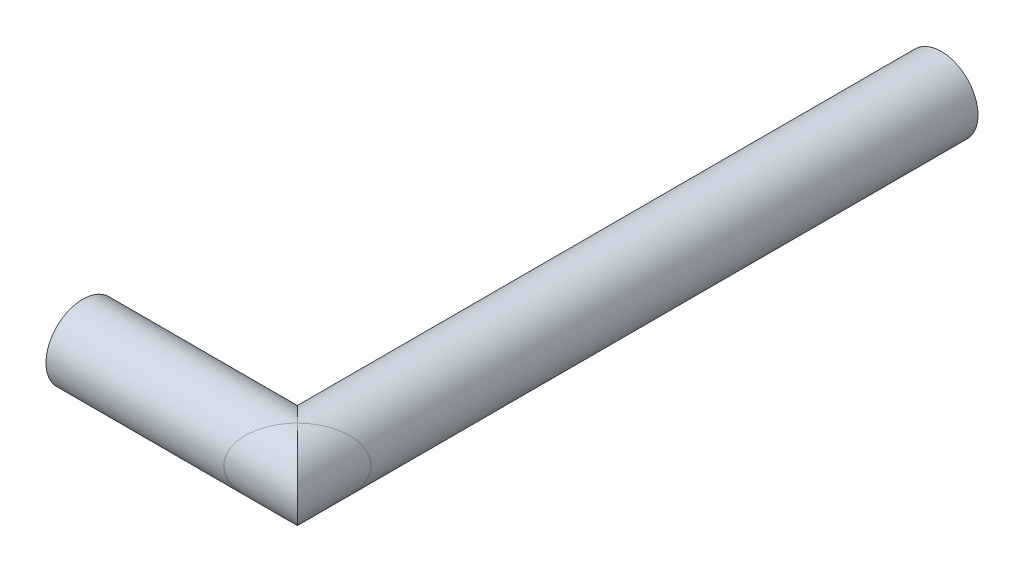
ISO-10303-21;
HEADER;
FILE_DESCRIPTION(('STEP AP214'),'2;1');
FILE_NAME('part.step','',(''),(''),'','','');
FILE_SCHEMA(('AUTOMOTIVE_DESIGN { 1 0 10303 214 1 1 1 1 }'));
ENDSEC;
DATA;
#1=APPLICATION_CONTEXT('core data for automotive mechanical design processes');
#2=APPLICATION_PROTOCOL_DEFINITION('international standard','automotive_design',2000,#1);
#3=PRODUCT_CONTEXT('',#1,'mechanical');
#4=PRODUCT('Part','Part','',(#3));
#5=PRODUCT_RELATED_PRODUCT_CATEGORY('part','',(#4));
#6=PRODUCT_DEFINITION_FORMATION('','',#4);
#7=PRODUCT_DEFINITION_CONTEXT('part definition',#1,'design');
#8=PRODUCT_DEFINITION('design','',#6,#7);
#9=PRODUCT_DEFINITION_SHAPE('','',#8);
#10=(LENGTH_UNIT() NAMED_UNIT(*) SI_UNIT(.MILLI.,.METRE.));
#11=(NAMED_UNIT(*) PLANE_ANGLE_UNIT() SI_UNIT($,.RADIAN.));
#12=(NAMED_UNIT(*) SI_UNIT($,.STERADIAN.) SOLID_ANGLE_UNIT());
#13=UNCERTAINTY_MEASURE_WITH_UNIT(LENGTH_MEASURE(1.E-05),#10,'distance_accuracy_value','');
#14=(GEOMETRIC_REPRESENTATION_CONTEXT(3) GLOBAL_UNCERTAINTY_ASSIGNED_CONTEXT((#13)) GLOBAL_UNIT_ASSIGNED_CONTEXT((#10,
#11,#12)) REPRESENTATION_CONTEXT('',''));
#15=CARTESIAN_POINT('',(0.,0.,0.));
#16=DIRECTION('',(0.,0.,1.));
#17=DIRECTION('',(1.,0.,0.));
#18=AXIS2_PLACEMENT_3D('',#15,#16,#17);
#19=CARTESIAN_POINT('',(5.,0.,0.95));
#20=DIRECTION('',(0.,0.,-1.));
#21=DIRECTION('',(0.,-1.,0.));
#22=AXIS2_PLACEMENT_3D('',#19,#20,#21);
#23=CYLINDRICAL_SURFACE('',#22,0.3);
#24=CARTESIAN_POINT('',(5.,0.,1.25));
#25=DIRECTION('',(-0.707106781186548,0.,-0.707106781186547));
#26=DIRECTION('',(0.707106781186547,0.,-0.707106781186548));
#27=AXIS2_PLACEMENT_3D('',#24,#25,#26);
#28=ELLIPSE('',#27,0.424264068711929,0.3);
#29=CARTESIAN_POINT('',(5.,-0.3,1.25));
#30=VERTEX_POINT('',#29);
#31=CARTESIAN_POINT('',(5.,0.3,1.25));
#32=VERTEX_POINT('',#31);
#33=EDGE_CURVE('E30',#30,#32,#28,.F.);
#34=ORIENTED_EDGE('',*,*,#33,.T.);
#35=CARTESIAN_POINT('',(5.,0.,1.25));
#36=DIRECTION('',(0.707106781186547,0.,-0.707106781186548));
#37=DIRECTION('',(-0.707106781186548,0.,-0.707106781186547));
#38=AXIS2_PLACEMENT_3D('',#35,#36,#37);
#39=ELLIPSE('',#38,0.424264068711929,0.3);
#40=EDGE_CURVE('E24',#32,#30,#39,.T.);
#41=ORIENTED_EDGE('',*,*,#40,.T.);
#42=EDGE_LOOP('',(#34,#41));
#43=FACE_BOUND('',#42,.T.);
#44=ADVANCED_FACE('F16',(#43),#23,.T.);
#45=CARTESIAN_POINT('',(5.,0.,1.25));
#46=DIRECTION('',(0.707106781186547,0.,-0.707106781186548));
#47=DIRECTION('',(-0.707106781186548,0.,-0.707106781186547));
#48=AXIS2_PLACEMENT_3D('',#45,#46,#47);
#49=ELLIPSE('',#48,0.424264068711929,0.3);
#50=EDGE_CURVE('E10',#32,#30,#49,.F.);
#51=ORIENTED_EDGE('',*,*,#50,.F.);
#52=ORIENTED_EDGE('',*,*,#33,.F.);
#53=EDGE_LOOP('',(#51,#52));
#54=FACE_BOUND('',#53,.T.);
#55=CARTESIAN_POINT('',(5.,0.,-4.));
#56=DIRECTION('',(0.,0.,1.));
#57=DIRECTION('',(0.,-1.,0.));
#58=AXIS2_PLACEMENT_3D('',#55,#56,#57);
#59=CIRCLE('',#58,0.3);
#60=CARTESIAN_POINT('',(5.,-0.300000000000001,-4.));
#61=VERTEX_POINT('',#60);
#62=EDGE_CURVE('E37',#61,#61,#59,.T.);
#63=ORIENTED_EDGE('',*,*,#62,.T.);
#64=EDGE_LOOP('',(#63));
#65=FACE_BOUND('',#64,.T.);
#66=ADVANCED_FACE('F33',(#54,#65),#23,.T.);
#67=CARTESIAN_POINT('',(5.,0.,-4.));
#68=DIRECTION('',(0.,0.,1.));
#69=DIRECTION('',(1.,0.,0.));
#70=AXIS2_PLACEMENT_3D('',#67,#68,#69);
#71=PLANE('',#70);
#72=ORIENTED_EDGE('',*,*,#62,.F.);
#73=EDGE_LOOP('',(#72));
#74=FACE_BOUND('',#73,.T.);
#75=ADVANCED_FACE('F58',(#74),#71,.F.);
#76=CARTESIAN_POINT('',(3.4,0.,1.25));
#77=DIRECTION('',(1.,0.,0.));
#78=DIRECTION('',(0.,-1.,0.));
#79=AXIS2_PLACEMENT_3D('',#76,#77,#78);
#80=CYLINDRICAL_SURFACE('',#79,0.3);
#81=CARTESIAN_POINT('',(3.25,0.,1.25));
#82=DIRECTION('',(-1.,0.,0.));
#83=DIRECTION('',(0.,-1.,0.));
#84=AXIS2_PLACEMENT_3D('',#81,#82,#83);
#85=CIRCLE('',#84,0.3);
#86=CARTESIAN_POINT('',(3.25,-0.300000000000001,1.25));
#87=VERTEX_POINT('',#86);
#88=EDGE_CURVE('E46',#87,#87,#85,.T.);
#89=ORIENTED_EDGE('',*,*,#88,.F.);
#90=EDGE_LOOP('',(#89));
#91=FACE_BOUND('',#90,.T.);
#92=CARTESIAN_POINT('',(5.,0.,1.25));
#93=DIRECTION('',(-0.707106781186548,0.,-0.707106781186547));
#94=DIRECTION('',(0.707106781186547,0.,-0.707106781186548));
#95=AXIS2_PLACEMENT_3D('',#92,#93,#94);
#96=ELLIPSE('',#95,0.424264068711929,0.3);
#97=EDGE_CURVE('E36',#30,#32,#96,.T.);
#98=ORIENTED_EDGE('',*,*,#97,.T.);
#99=ORIENTED_EDGE('',*,*,#50,.T.);
#100=EDGE_LOOP('',(#98,#99));
#101=FACE_BOUND('',#100,.T.);
#102=ADVANCED_FACE('F41',(#91,#101),#80,.T.);
#103=ORIENTED_EDGE('',*,*,#40,.F.);
#104=ORIENTED_EDGE('',*,*,#97,.F.);
#105=EDGE_LOOP('',(#103,#104));
#106=FACE_BOUND('',#105,.T.);
#107=ADVANCED_FACE('F18',(#106),#80,.T.);
#108=CARTESIAN_POINT('',(3.25,0.,1.25));
#109=DIRECTION('',(-1.,0.,0.));
#110=DIRECTION('',(0.,1.,0.));
#111=AXIS2_PLACEMENT_3D('',#108,#109,#110);
#112=PLANE('',#111);
#113=ORIENTED_EDGE('',*,*,#88,.T.);
#114=EDGE_LOOP('',(#113));
#115=FACE_BOUND('',#114,.T.);
#116=ADVANCED_FACE('F107',(#115),#112,.T.);
#117=CLOSED_SHELL('',(#44,#66,#75,#102,#107,#116));
#118=MANIFOLD_SOLID_BREP('B1',#117);
#119=ADVANCED_BREP_SHAPE_REPRESENTATION('',(#18,#118),#14);
#120=SHAPE_DEFINITION_REPRESENTATION(#9,#119);
ENDSEC;
END-ISO-10303-21;
